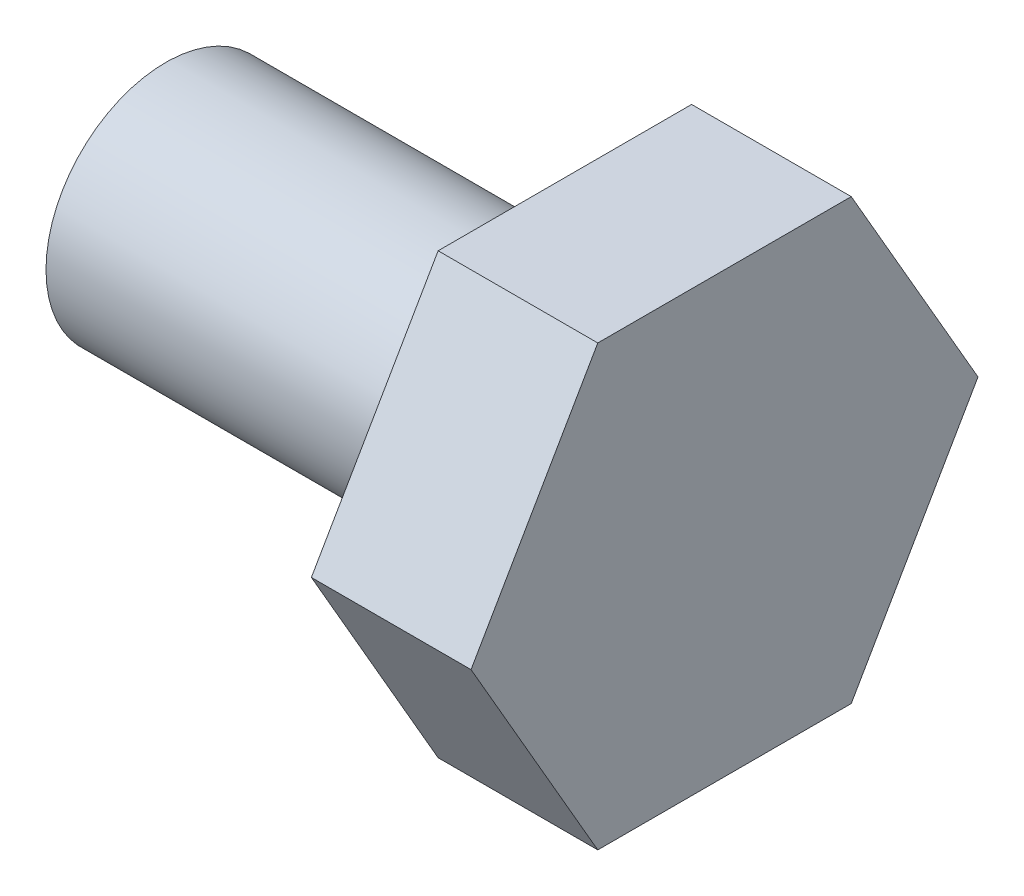
ISO-10303-21;
HEADER;
FILE_DESCRIPTION(('STEP AP214'),'2;1');
FILE_NAME('part.step','',(''),(''),'','','');
FILE_SCHEMA(('AUTOMOTIVE_DESIGN { 1 0 10303 214 1 1 1 1 }'));
ENDSEC;
DATA;
#1=APPLICATION_CONTEXT('core data for automotive mechanical design processes');
#2=APPLICATION_PROTOCOL_DEFINITION('international standard','automotive_design',2000,#1);
#3=PRODUCT_CONTEXT('',#1,'mechanical');
#4=PRODUCT('Part','Part','',(#3));
#5=PRODUCT_RELATED_PRODUCT_CATEGORY('part','',(#4));
#6=PRODUCT_DEFINITION_FORMATION('','',#4);
#7=PRODUCT_DEFINITION_CONTEXT('part definition',#1,'design');
#8=PRODUCT_DEFINITION('design','',#6,#7);
#9=PRODUCT_DEFINITION_SHAPE('','',#8);
#10=(LENGTH_UNIT() NAMED_UNIT(*) SI_UNIT(.MILLI.,.METRE.));
#11=(NAMED_UNIT(*) PLANE_ANGLE_UNIT() SI_UNIT($,.RADIAN.));
#12=(NAMED_UNIT(*) SI_UNIT($,.STERADIAN.) SOLID_ANGLE_UNIT());
#13=UNCERTAINTY_MEASURE_WITH_UNIT(LENGTH_MEASURE(1.E-05),#10,'distance_accuracy_value','');
#14=(GEOMETRIC_REPRESENTATION_CONTEXT(3) GLOBAL_UNCERTAINTY_ASSIGNED_CONTEXT((#13)) GLOBAL_UNIT_ASSIGNED_CONTEXT((#10,
#11,#12)) REPRESENTATION_CONTEXT('',''));
#15=CARTESIAN_POINT('',(0.,0.,0.));
#16=DIRECTION('',(0.,0.,1.));
#17=DIRECTION('',(1.,0.,0.));
#18=AXIS2_PLACEMENT_3D('',#15,#16,#17);
#19=CARTESIAN_POINT('',(-2.5,0.,0.));
#20=DIRECTION('',(1.,0.,0.));
#21=DIRECTION('',(0.,0.,-1.));
#22=AXIS2_PLACEMENT_3D('',#19,#20,#21);
#23=PLANE('',#22);
#24=CARTESIAN_POINT('',(-2.5,0.,0.));
#25=DIRECTION('',(-1.,0.,0.));
#26=DIRECTION('',(0.,0.,1.));
#27=AXIS2_PLACEMENT_3D('',#24,#25,#26);
#28=CIRCLE('',#27,1.5);
#29=CARTESIAN_POINT('',(-2.5,0.,1.5));
#30=VERTEX_POINT('',#29);
#31=EDGE_CURVE('E11',#30,#30,#28,.T.);
#32=ORIENTED_EDGE('',*,*,#31,.T.);
#33=EDGE_LOOP('',(#32));
#34=FACE_BOUND('',#33,.T.);
#35=ADVANCED_FACE('F32',(#34),#23,.F.);
#36=CARTESIAN_POINT('',(-16.1666064462759,0.,0.));
#37=DIRECTION('',(-1.,0.,0.));
#38=DIRECTION('',(0.,0.,1.));
#39=AXIS2_PLACEMENT_3D('',#36,#37,#38);
#40=CYLINDRICAL_SURFACE('',#39,1.5);
#41=ORIENTED_EDGE('',*,*,#31,.F.);
#42=EDGE_LOOP('',(#41));
#43=FACE_BOUND('',#42,.T.);
#44=CARTESIAN_POINT('',(2.5,0.,0.));
#45=DIRECTION('',(1.,0.,0.));
#46=DIRECTION('',(0.,0.,-1.));
#47=AXIS2_PLACEMENT_3D('',#44,#45,#46);
#48=CIRCLE('',#47,1.5);
#49=CARTESIAN_POINT('',(2.5,0.,-1.5));
#50=VERTEX_POINT('',#49);
#51=EDGE_CURVE('E40',#50,#50,#48,.T.);
#52=ORIENTED_EDGE('',*,*,#51,.F.);
#53=EDGE_LOOP('',(#52));
#54=FACE_BOUND('',#53,.T.);
#55=ADVANCED_FACE('F140',(#43,#54),#40,.T.);
#56=CARTESIAN_POINT('',(2.5,2.75,-1.58771324027147));
#57=DIRECTION('',(1.,0.,0.));
#58=DIRECTION('',(0.,0.,-1.));
#59=AXIS2_PLACEMENT_3D('',#56,#57,#58);
#60=PLANE('',#59);
#61=DIRECTION('',(0.,0.866025403784439,0.5));
#62=VECTOR('',#61,1.);
#63=CARTESIAN_POINT('',(2.5,0.,-3.17542648054294));
#64=LINE('',#63,#62);
#65=CARTESIAN_POINT('',(2.5,0.,-3.17542648054294));
#66=VERTEX_POINT('',#65);
#67=CARTESIAN_POINT('',(2.5,2.75,-1.58771324027147));
#68=VERTEX_POINT('',#67);
#69=EDGE_CURVE('E117',#66,#68,#64,.T.);
#70=ORIENTED_EDGE('',*,*,#69,.F.);
#71=DIRECTION('',(0.,0.866025403784439,-0.5));
#72=VECTOR('',#71,1.);
#73=CARTESIAN_POINT('',(2.5,-2.75,-1.58771324027147));
#74=LINE('',#73,#72);
#75=CARTESIAN_POINT('',(2.5,-2.75,-1.58771324027147));
#76=VERTEX_POINT('',#75);
#77=EDGE_CURVE('E77',#76,#66,#74,.T.);
#78=ORIENTED_EDGE('',*,*,#77,.F.);
#79=DIRECTION('',(0.,0.,-1.));
#80=VECTOR('',#79,1.);
#81=CARTESIAN_POINT('',(2.5,-2.75,1.58771324027147));
#82=LINE('',#81,#80);
#83=CARTESIAN_POINT('',(2.5,-2.75,1.58771324027147));
#84=VERTEX_POINT('',#83);
#85=EDGE_CURVE('E71',#84,#76,#82,.T.);
#86=ORIENTED_EDGE('',*,*,#85,.F.);
#87=DIRECTION('',(0.,-0.866025403784439,-0.5));
#88=VECTOR('',#87,1.);
#89=CARTESIAN_POINT('',(2.5,0.,3.17542648054294));
#90=LINE('',#89,#88);
#91=CARTESIAN_POINT('',(2.5,0.,3.17542648054294));
#92=VERTEX_POINT('',#91);
#93=EDGE_CURVE('E107',#92,#84,#90,.T.);
#94=ORIENTED_EDGE('',*,*,#93,.F.);
#95=DIRECTION('',(0.,-0.866025403784439,0.5));
#96=VECTOR('',#95,1.);
#97=CARTESIAN_POINT('',(2.5,2.75,1.58771324027147));
#98=LINE('',#97,#96);
#99=CARTESIAN_POINT('',(2.5,2.75,1.58771324027147));
#100=VERTEX_POINT('',#99);
#101=EDGE_CURVE('E122',#100,#92,#98,.T.);
#102=ORIENTED_EDGE('',*,*,#101,.F.);
#103=DIRECTION('',(0.,0.,1.));
#104=VECTOR('',#103,1.);
#105=CARTESIAN_POINT('',(2.5,2.75,-1.58771324027147));
#106=LINE('',#105,#104);
#107=EDGE_CURVE('E120',#68,#100,#106,.T.);
#108=ORIENTED_EDGE('',*,*,#107,.F.);
#109=EDGE_LOOP('',(#70,#78,#86,#94,#102,#108));
#110=FACE_BOUND('',#109,.T.);
#111=ORIENTED_EDGE('',*,*,#51,.T.);
#112=EDGE_LOOP('',(#111));
#113=FACE_BOUND('',#112,.T.);
#114=ADVANCED_FACE('F138',(#110,#113),#60,.F.);
#115=CARTESIAN_POINT('',(4.5,0.,-3.17542648054294));
#116=DIRECTION('',(0.,-0.5,0.866025403784439));
#117=DIRECTION('',(0.,-0.866025403784439,-0.5));
#118=AXIS2_PLACEMENT_3D('',#115,#116,#117);
#119=PLANE('',#118);
#120=ORIENTED_EDGE('',*,*,#69,.T.);
#121=DIRECTION('',(-1.,0.,0.));
#122=VECTOR('',#121,1.);
#123=CARTESIAN_POINT('',(4.5,2.75,-1.58771324027147));
#124=LINE('',#123,#122);
#125=CARTESIAN_POINT('',(4.5,2.75,-1.58771324027147));
#126=VERTEX_POINT('',#125);
#127=EDGE_CURVE('E134',#126,#68,#124,.T.);
#128=ORIENTED_EDGE('',*,*,#127,.F.);
#129=DIRECTION('',(0.,0.866025403784439,0.5));
#130=VECTOR('',#129,1.);
#131=CARTESIAN_POINT('',(4.5,0.,-3.17542648054294));
#132=LINE('',#131,#130);
#133=CARTESIAN_POINT('',(4.5,0.,-3.17542648054294));
#134=VERTEX_POINT('',#133);
#135=EDGE_CURVE('E127',#134,#126,#132,.T.);
#136=ORIENTED_EDGE('',*,*,#135,.F.);
#137=DIRECTION('',(-1.,0.,0.));
#138=VECTOR('',#137,1.);
#139=CARTESIAN_POINT('',(4.5,0.,-3.17542648054294));
#140=LINE('',#139,#138);
#141=EDGE_CURVE('E113',#134,#66,#140,.T.);
#142=ORIENTED_EDGE('',*,*,#141,.T.);
#143=EDGE_LOOP('',(#120,#128,#136,#142));
#144=FACE_BOUND('',#143,.T.);
#145=ADVANCED_FACE('F147',(#144),#119,.F.);
#146=CARTESIAN_POINT('',(4.5,2.75,-1.58771324027147));
#147=DIRECTION('',(0.,-1.,0.));
#148=DIRECTION('',(0.,0.,-1.));
#149=AXIS2_PLACEMENT_3D('',#146,#147,#148);
#150=PLANE('',#149);
#151=ORIENTED_EDGE('',*,*,#107,.T.);
#152=DIRECTION('',(-1.,0.,0.));
#153=VECTOR('',#152,1.);
#154=CARTESIAN_POINT('',(4.5,2.75,1.58771324027147));
#155=LINE('',#154,#153);
#156=CARTESIAN_POINT('',(4.5,2.75,1.58771324027147));
#157=VERTEX_POINT('',#156);
#158=EDGE_CURVE('E131',#157,#100,#155,.T.);
#159=ORIENTED_EDGE('',*,*,#158,.F.);
#160=DIRECTION('',(0.,0.,1.));
#161=VECTOR('',#160,1.);
#162=CARTESIAN_POINT('',(4.5,2.75,-1.58771324027147));
#163=LINE('',#162,#161);
#164=EDGE_CURVE('E86',#126,#157,#163,.T.);
#165=ORIENTED_EDGE('',*,*,#164,.F.);
#166=ORIENTED_EDGE('',*,*,#127,.T.);
#167=EDGE_LOOP('',(#151,#159,#165,#166));
#168=FACE_BOUND('',#167,.T.);
#169=ADVANCED_FACE('F155',(#168),#150,.F.);
#170=CARTESIAN_POINT('',(4.5,2.75,1.58771324027147));
#171=DIRECTION('',(0.,-0.5,-0.866025403784439));
#172=DIRECTION('',(0.,0.866025403784439,-0.5));
#173=AXIS2_PLACEMENT_3D('',#170,#171,#172);
#174=PLANE('',#173);
#175=ORIENTED_EDGE('',*,*,#101,.T.);
#176=DIRECTION('',(-1.,0.,0.));
#177=VECTOR('',#176,1.);
#178=CARTESIAN_POINT('',(4.5,0.,3.17542648054294));
#179=LINE('',#178,#177);
#180=CARTESIAN_POINT('',(4.5,0.,3.17542648054294));
#181=VERTEX_POINT('',#180);
#182=EDGE_CURVE('E108',#181,#92,#179,.T.);
#183=ORIENTED_EDGE('',*,*,#182,.F.);
#184=DIRECTION('',(0.,-0.866025403784439,0.5));
#185=VECTOR('',#184,1.);
#186=CARTESIAN_POINT('',(4.5,2.75,1.58771324027147));
#187=LINE('',#186,#185);
#188=EDGE_CURVE('E99',#157,#181,#187,.T.);
#189=ORIENTED_EDGE('',*,*,#188,.F.);
#190=ORIENTED_EDGE('',*,*,#158,.T.);
#191=EDGE_LOOP('',(#175,#183,#189,#190));
#192=FACE_BOUND('',#191,.T.);
#193=ADVANCED_FACE('F159',(#192),#174,.F.);
#194=CARTESIAN_POINT('',(4.5,0.,3.17542648054294));
#195=DIRECTION('',(0.,0.5,-0.866025403784439));
#196=DIRECTION('',(0.,0.866025403784439,0.5));
#197=AXIS2_PLACEMENT_3D('',#194,#195,#196);
#198=PLANE('',#197);
#199=ORIENTED_EDGE('',*,*,#93,.T.);
#200=DIRECTION('',(-1.,0.,0.));
#201=VECTOR('',#200,1.);
#202=CARTESIAN_POINT('',(4.5,-2.75,1.58771324027147));
#203=LINE('',#202,#201);
#204=CARTESIAN_POINT('',(4.5,-2.75,1.58771324027147));
#205=VERTEX_POINT('',#204);
#206=EDGE_CURVE('E104',#205,#84,#203,.T.);
#207=ORIENTED_EDGE('',*,*,#206,.F.);
#208=DIRECTION('',(0.,-0.866025403784439,-0.5));
#209=VECTOR('',#208,1.);
#210=CARTESIAN_POINT('',(4.5,0.,3.17542648054294));
#211=LINE('',#210,#209);
#212=EDGE_CURVE('E93',#181,#205,#211,.T.);
#213=ORIENTED_EDGE('',*,*,#212,.F.);
#214=ORIENTED_EDGE('',*,*,#182,.T.);
#215=EDGE_LOOP('',(#199,#207,#213,#214));
#216=FACE_BOUND('',#215,.T.);
#217=ADVANCED_FACE('F105',(#216),#198,.F.);
#218=CARTESIAN_POINT('',(4.5,-2.75,1.58771324027147));
#219=DIRECTION('',(0.,1.,0.));
#220=DIRECTION('',(0.,0.,1.));
#221=AXIS2_PLACEMENT_3D('',#218,#219,#220);
#222=PLANE('',#221);
#223=ORIENTED_EDGE('',*,*,#85,.T.);
#224=DIRECTION('',(-1.,0.,0.));
#225=VECTOR('',#224,1.);
#226=CARTESIAN_POINT('',(4.5,-2.75,-1.58771324027147));
#227=LINE('',#226,#225);
#228=CARTESIAN_POINT('',(4.5,-2.75,-1.58771324027147));
#229=VERTEX_POINT('',#228);
#230=EDGE_CURVE('E109',#229,#76,#227,.T.);
#231=ORIENTED_EDGE('',*,*,#230,.F.);
#232=DIRECTION('',(0.,0.,-1.));
#233=VECTOR('',#232,1.);
#234=CARTESIAN_POINT('',(4.5,-2.75,1.58771324027147));
#235=LINE('',#234,#233);
#236=EDGE_CURVE('E97',#205,#229,#235,.T.);
#237=ORIENTED_EDGE('',*,*,#236,.F.);
#238=ORIENTED_EDGE('',*,*,#206,.T.);
#239=EDGE_LOOP('',(#223,#231,#237,#238));
#240=FACE_BOUND('',#239,.T.);
#241=ADVANCED_FACE('F111',(#240),#222,.F.);
#242=CARTESIAN_POINT('',(4.5,-2.75,-1.58771324027147));
#243=DIRECTION('',(0.,0.5,0.866025403784439));
#244=DIRECTION('',(0.,-0.866025403784439,0.5));
#245=AXIS2_PLACEMENT_3D('',#242,#243,#244);
#246=PLANE('',#245);
#247=ORIENTED_EDGE('',*,*,#77,.T.);
#248=ORIENTED_EDGE('',*,*,#141,.F.);
#249=DIRECTION('',(0.,0.866025403784439,-0.5));
#250=VECTOR('',#249,1.);
#251=CARTESIAN_POINT('',(4.5,-2.75,-1.58771324027147));
#252=LINE('',#251,#250);
#253=EDGE_CURVE('E48',#229,#134,#252,.T.);
#254=ORIENTED_EDGE('',*,*,#253,.F.);
#255=ORIENTED_EDGE('',*,*,#230,.T.);
#256=EDGE_LOOP('',(#247,#248,#254,#255));
#257=FACE_BOUND('',#256,.T.);
#258=ADVANCED_FACE('F167',(#257),#246,.F.);
#259=CARTESIAN_POINT('',(4.5,2.75,-1.58771324027147));
#260=DIRECTION('',(1.,0.,0.));
#261=DIRECTION('',(0.,0.,-1.));
#262=AXIS2_PLACEMENT_3D('',#259,#260,#261);
#263=PLANE('',#262);
#264=ORIENTED_EDGE('',*,*,#135,.T.);
#265=ORIENTED_EDGE('',*,*,#164,.T.);
#266=ORIENTED_EDGE('',*,*,#188,.T.);
#267=ORIENTED_EDGE('',*,*,#212,.T.);
#268=ORIENTED_EDGE('',*,*,#236,.T.);
#269=ORIENTED_EDGE('',*,*,#253,.T.);
#270=EDGE_LOOP('',(#264,#265,#266,#267,#268,#269));
#271=FACE_BOUND('',#270,.T.);
#272=ADVANCED_FACE('F95',(#271),#263,.T.);
#273=CLOSED_SHELL('',(#35,#55,#114,#145,#169,#193,#217,#241,#258,#272));
#274=MANIFOLD_SOLID_BREP('B2',#273);
#275=ADVANCED_BREP_SHAPE_REPRESENTATION('',(#18,#274),#14);
#276=SHAPE_DEFINITION_REPRESENTATION(#9,#275);
ENDSEC;
END-ISO-10303-21;
